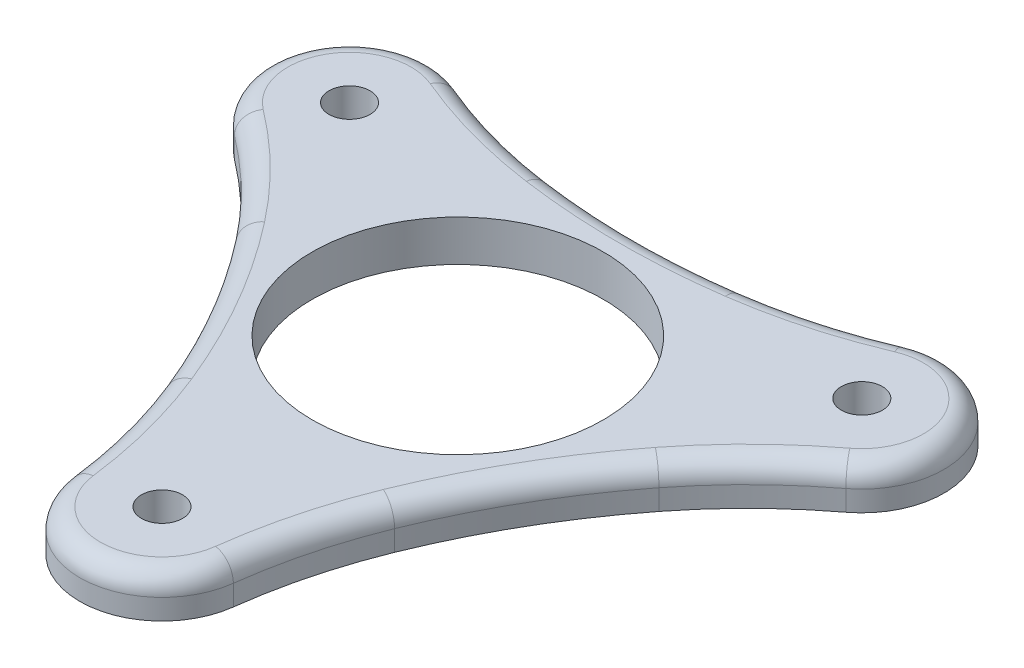
ISO-10303-21;
HEADER;
FILE_DESCRIPTION(('STEP AP214'),'2;1');
FILE_NAME('part.step','',(''),(''),'','','');
FILE_SCHEMA(('AUTOMOTIVE_DESIGN { 1 0 10303 214 1 1 1 1 }'));
ENDSEC;
DATA;
#1=APPLICATION_CONTEXT('core data for automotive mechanical design processes');
#2=APPLICATION_PROTOCOL_DEFINITION('international standard','automotive_design',2000,#1);
#3=PRODUCT_CONTEXT('',#1,'mechanical');
#4=PRODUCT('Part','Part','',(#3));
#5=PRODUCT_RELATED_PRODUCT_CATEGORY('part','',(#4));
#6=PRODUCT_DEFINITION_FORMATION('','',#4);
#7=PRODUCT_DEFINITION_CONTEXT('part definition',#1,'design');
#8=PRODUCT_DEFINITION('design','',#6,#7);
#9=PRODUCT_DEFINITION_SHAPE('','',#8);
#10=(LENGTH_UNIT() NAMED_UNIT(*) SI_UNIT(.MILLI.,.METRE.));
#11=(NAMED_UNIT(*) PLANE_ANGLE_UNIT() SI_UNIT($,.RADIAN.));
#12=(NAMED_UNIT(*) SI_UNIT($,.STERADIAN.) SOLID_ANGLE_UNIT());
#13=UNCERTAINTY_MEASURE_WITH_UNIT(LENGTH_MEASURE(1.E-05),#10,'distance_accuracy_value','');
#14=(GEOMETRIC_REPRESENTATION_CONTEXT(3) GLOBAL_UNCERTAINTY_ASSIGNED_CONTEXT((#13)) GLOBAL_UNIT_ASSIGNED_CONTEXT((#10,
#11,#12)) REPRESENTATION_CONTEXT('',''));
#15=CARTESIAN_POINT('',(0.,0.,0.));
#16=DIRECTION('',(0.,0.,1.));
#17=DIRECTION('',(1.,0.,0.));
#18=AXIS2_PLACEMENT_3D('',#15,#16,#17);
#19=CARTESIAN_POINT('',(0.,6.35,45.72));
#20=DIRECTION('',(0.,-1.,0.));
#21=DIRECTION('',(0.,0.,-1.));
#22=AXIS2_PLACEMENT_3D('',#19,#20,#21);
#23=CYLINDRICAL_SURFACE('',#22,12.7000000000002);
#24=DIRECTION('',(0.,-1.,0.));
#25=VECTOR('',#24,1.);
#26=CARTESIAN_POINT('',(12.6021572831834,6.35,47.2934140618133));
#27=LINE('',#26,#25);
#28=CARTESIAN_POINT('',(12.6021572831834,0.,47.2934140618133));
#29=VERTEX_POINT('',#28);
#30=CARTESIAN_POINT('',(12.6021572831834,3.175,47.2934140618133));
#31=VERTEX_POINT('',#30);
#32=EDGE_CURVE('E216',#29,#31,#27,.F.);
#33=ORIENTED_EDGE('',*,*,#32,.T.);
#34=CARTESIAN_POINT('',(0.,3.175,45.72));
#35=DIRECTION('',(0.,1.,0.));
#36=DIRECTION('',(0.,0.,1.));
#37=AXIS2_PLACEMENT_3D('',#34,#35,#36);
#38=CIRCLE('',#37,12.7000000000002);
#39=CARTESIAN_POINT('',(-12.6021572831834,3.175,47.293414061813));
#40=VERTEX_POINT('',#39);
#41=EDGE_CURVE('E264',#31,#40,#38,.F.);
#42=ORIENTED_EDGE('',*,*,#41,.T.);
#43=DIRECTION('',(0.,-1.,0.));
#44=VECTOR('',#43,1.);
#45=CARTESIAN_POINT('',(-12.6021572831834,6.35,47.293414061813));
#46=LINE('',#45,#44);
#47=CARTESIAN_POINT('',(-12.6021572831834,0.,47.293414061813));
#48=VERTEX_POINT('',#47);
#49=EDGE_CURVE('E219',#40,#48,#46,.T.);
#50=ORIENTED_EDGE('',*,*,#49,.T.);
#51=CARTESIAN_POINT('',(0.,0.,45.72));
#52=DIRECTION('',(0.,1.,0.));
#53=DIRECTION('',(0.,0.,1.));
#54=AXIS2_PLACEMENT_3D('',#51,#52,#53);
#55=CIRCLE('',#54,12.7000000000002);
#56=EDGE_CURVE('E334',#48,#29,#55,.T.);
#57=ORIENTED_EDGE('',*,*,#56,.T.);
#58=EDGE_LOOP('',(#33,#42,#50,#57));
#59=FACE_BOUND('',#58,.T.);
#60=ADVANCED_FACE('F37',(#59),#23,.T.);
#61=CARTESIAN_POINT('',(117.729531836529,6.35,67.9711768973876));
#62=DIRECTION('',(0.,-1.,0.));
#63=DIRECTION('',(0.,0.,-1.));
#64=AXIS2_PLACEMENT_3D('',#61,#62,#63);
#65=CYLINDRICAL_SURFACE('',#64,107.860080687774);
#66=DIRECTION('',(0.,-1.,0.));
#67=VECTOR('',#66,1.);
#68=CARTESIAN_POINT('',(32.7001507195463,6.35,1.61003350130014));
#69=LINE('',#68,#67);
#70=CARTESIAN_POINT('',(32.7001507195463,0.,1.61003350130014));
#71=VERTEX_POINT('',#70);
#72=CARTESIAN_POINT('',(32.7001507195463,3.175,1.61003350130014));
#73=VERTEX_POINT('',#72);
#74=EDGE_CURVE('E221',#71,#73,#69,.F.);
#75=ORIENTED_EDGE('',*,*,#74,.T.);
#76=CARTESIAN_POINT('',(117.729531836529,3.175,67.9711768973876));
#77=DIRECTION('',(0.,1.,0.));
#78=DIRECTION('',(0.,0.,1.));
#79=AXIS2_PLACEMENT_3D('',#76,#77,#78);
#80=CIRCLE('',#79,107.860080687774);
#81=CARTESIAN_POINT('',(17.7444052728414,3.175,27.5141444800616));
#82=VERTEX_POINT('',#81);
#83=EDGE_CURVE('E259',#73,#82,#80,.T.);
#84=ORIENTED_EDGE('',*,*,#83,.T.);
#85=DIRECTION('',(0.,-1.,0.));
#86=VECTOR('',#85,1.);
#87=CARTESIAN_POINT('',(17.7444052728414,6.35,27.5141444800616));
#88=LINE('',#87,#86);
#89=CARTESIAN_POINT('',(17.7444052728415,0.,27.5141444800617));
#90=VERTEX_POINT('',#89);
#91=EDGE_CURVE('E183',#82,#90,#88,.T.);
#92=ORIENTED_EDGE('',*,*,#91,.T.);
#93=CARTESIAN_POINT('',(117.729531836529,0.,67.9711768973876));
#94=DIRECTION('',(0.,1.,0.));
#95=DIRECTION('',(0.,0.,1.));
#96=AXIS2_PLACEMENT_3D('',#93,#94,#95);
#97=CIRCLE('',#96,107.860080687774);
#98=EDGE_CURVE('E195',#90,#71,#97,.F.);
#99=ORIENTED_EDGE('',*,*,#98,.T.);
#100=EDGE_LOOP('',(#75,#84,#92,#99));
#101=FACE_BOUND('',#100,.T.);
#102=ADVANCED_FACE('F340',(#101),#65,.F.);
#103=CARTESIAN_POINT('',(39.5946814610279,6.35,-22.8600000000044));
#104=DIRECTION('',(0.,-1.,0.));
#105=DIRECTION('',(0.,0.,-1.));
#106=AXIS2_PLACEMENT_3D('',#103,#104,#105);
#107=CYLINDRICAL_SURFACE('',#106,12.7000000000013);
#108=DIRECTION('',(0.,-1.,0.));
#109=VECTOR('',#108,1.);
#110=CARTESIAN_POINT('',(34.656219367638,6.35,-34.560495380636));
#111=LINE('',#110,#109);
#112=CARTESIAN_POINT('',(34.656219367638,0.,-34.560495380636));
#113=VERTEX_POINT('',#112);
#114=CARTESIAN_POINT('',(34.656219367638,3.175,-34.560495380636));
#115=VERTEX_POINT('',#114);
#116=EDGE_CURVE('E178',#113,#115,#111,.F.);
#117=ORIENTED_EDGE('',*,*,#116,.T.);
#118=CARTESIAN_POINT('',(39.5946814610279,3.175,-22.8600000000044));
#119=DIRECTION('',(0.,1.,0.));
#120=DIRECTION('',(0.,0.,1.));
#121=AXIS2_PLACEMENT_3D('',#118,#119,#120);
#122=CIRCLE('',#121,12.7000000000013);
#123=CARTESIAN_POINT('',(47.2583766508217,3.175,-12.7329186811858));
#124=VERTEX_POINT('',#123);
#125=EDGE_CURVE('E46',#115,#124,#122,.F.);
#126=ORIENTED_EDGE('',*,*,#125,.T.);
#127=DIRECTION('',(0.,-1.,0.));
#128=VECTOR('',#127,1.);
#129=CARTESIAN_POINT('',(47.2583766508217,6.35,-12.7329186811858));
#130=LINE('',#129,#128);
#131=CARTESIAN_POINT('',(47.2583766508217,0.,-12.7329186811858));
#132=VERTEX_POINT('',#131);
#133=EDGE_CURVE('E173',#124,#132,#130,.T.);
#134=ORIENTED_EDGE('',*,*,#133,.T.);
#135=CARTESIAN_POINT('',(39.5946814610279,0.,-22.8600000000044));
#136=DIRECTION('',(0.,1.,0.));
#137=DIRECTION('',(0.,0.,1.));
#138=AXIS2_PLACEMENT_3D('',#135,#136,#137);
#139=CIRCLE('',#138,12.7000000000013);
#140=EDGE_CURVE('E190',#132,#113,#139,.T.);
#141=ORIENTED_EDGE('',*,*,#140,.T.);
#142=EDGE_LOOP('',(#117,#126,#134,#141));
#143=FACE_BOUND('',#142,.T.);
#144=ADVANCED_FACE('F429',(#143),#107,.T.);
#145=CARTESIAN_POINT('',(7.22127890383623E-12,6.35,-135.942353794782));
#146=DIRECTION('',(0.,-1.,0.));
#147=DIRECTION('',(0.,0.,-1.));
#148=AXIS2_PLACEMENT_3D('',#145,#146,#147);
#149=CYLINDRICAL_SURFACE('',#148,107.860080687773);
#150=DIRECTION('',(0.,-1.,0.));
#151=VECTOR('',#150,1.);
#152=CARTESIAN_POINT('',(-14.9557454467395,6.35,-29.1241779813698));
#153=LINE('',#152,#151);
#154=CARTESIAN_POINT('',(-14.9557454467395,0.,-29.1241779813698));
#155=VERTEX_POINT('',#154);
#156=CARTESIAN_POINT('',(-14.9557454467395,3.175,-29.1241779813698));
#157=VERTEX_POINT('',#156);
#158=EDGE_CURVE('E174',#155,#157,#153,.F.);
#159=ORIENTED_EDGE('',*,*,#158,.T.);
#160=CARTESIAN_POINT('',(7.22127890383623E-12,3.175,-135.942353794782));
#161=DIRECTION('',(0.,1.,0.));
#162=DIRECTION('',(0.,0.,1.));
#163=AXIS2_PLACEMENT_3D('',#160,#161,#162);
#164=CIRCLE('',#163,107.860080687773);
#165=CARTESIAN_POINT('',(14.9557454467007,3.175,-29.1241779813624));
#166=VERTEX_POINT('',#165);
#167=EDGE_CURVE('E171',#157,#166,#164,.T.);
#168=ORIENTED_EDGE('',*,*,#167,.T.);
#169=DIRECTION('',(0.,-1.,0.));
#170=VECTOR('',#169,1.);
#171=CARTESIAN_POINT('',(14.9557454467007,6.35,-29.1241779813624));
#172=LINE('',#171,#170);
#173=CARTESIAN_POINT('',(14.9557454467008,0.,-29.1241779813623));
#174=VERTEX_POINT('',#173);
#175=EDGE_CURVE('E163',#166,#174,#172,.T.);
#176=ORIENTED_EDGE('',*,*,#175,.T.);
#177=CARTESIAN_POINT('',(7.22127890383623E-12,0.,-135.942353794782));
#178=DIRECTION('',(0.,1.,0.));
#179=DIRECTION('',(0.,0.,1.));
#180=AXIS2_PLACEMENT_3D('',#177,#178,#179);
#181=CIRCLE('',#180,107.860080687773);
#182=EDGE_CURVE('E168',#174,#155,#181,.F.);
#183=ORIENTED_EDGE('',*,*,#182,.T.);
#184=EDGE_LOOP('',(#159,#168,#176,#183));
#185=FACE_BOUND('',#184,.T.);
#186=ADVANCED_FACE('F166',(#185),#149,.F.);
#187=CARTESIAN_POINT('',(-39.5946814610245,6.35,-22.8600000000064));
#188=DIRECTION('',(0.,-1.,0.));
#189=DIRECTION('',(0.,0.,-1.));
#190=AXIS2_PLACEMENT_3D('',#187,#188,#189);
#191=CYLINDRICAL_SURFACE('',#190,12.7);
#192=DIRECTION('',(0.,-1.,0.));
#193=VECTOR('',#192,1.);
#194=CARTESIAN_POINT('',(-47.2583766508186,6.35,-12.7329186811896));
#195=LINE('',#194,#193);
#196=CARTESIAN_POINT('',(-47.2583766508186,0.,-12.7329186811896));
#197=VERTEX_POINT('',#196);
#198=CARTESIAN_POINT('',(-47.2583766508186,3.175,-12.7329186811896));
#199=VERTEX_POINT('',#198);
#200=EDGE_CURVE('E206',#197,#199,#195,.F.);
#201=ORIENTED_EDGE('',*,*,#200,.T.);
#202=CARTESIAN_POINT('',(-39.5946814610245,3.175,-22.8600000000064));
#203=DIRECTION('',(0.,1.,0.));
#204=DIRECTION('',(0.,0.,1.));
#205=AXIS2_PLACEMENT_3D('',#202,#203,#204);
#206=CIRCLE('',#205,12.7);
#207=CARTESIAN_POINT('',(-34.6562193676354,3.175,-34.560495380637));
#208=VERTEX_POINT('',#207);
#209=EDGE_CURVE('E272',#199,#208,#206,.F.);
#210=ORIENTED_EDGE('',*,*,#209,.T.);
#211=DIRECTION('',(0.,-1.,0.));
#212=VECTOR('',#211,1.);
#213=CARTESIAN_POINT('',(-34.6562193676354,6.35,-34.560495380637));
#214=LINE('',#213,#212);
#215=CARTESIAN_POINT('',(-34.6562193676354,0.,-34.560495380637));
#216=VERTEX_POINT('',#215);
#217=EDGE_CURVE('E209',#208,#216,#214,.T.);
#218=ORIENTED_EDGE('',*,*,#217,.T.);
#219=CARTESIAN_POINT('',(-39.5946814610245,0.,-22.8600000000064));
#220=DIRECTION('',(0.,1.,0.));
#221=DIRECTION('',(0.,0.,1.));
#222=AXIS2_PLACEMENT_3D('',#219,#220,#221);
#223=CIRCLE('',#222,12.7);
#224=EDGE_CURVE('E189',#216,#197,#223,.T.);
#225=ORIENTED_EDGE('',*,*,#224,.T.);
#226=EDGE_LOOP('',(#201,#210,#218,#225));
#227=FACE_BOUND('',#226,.T.);
#228=ADVANCED_FACE('F379',(#227),#191,.T.);
#229=CARTESIAN_POINT('',(39.5946814610245,6.35,-22.86));
#230=DIRECTION('',(0.,-1.,0.));
#231=DIRECTION('',(0.,0.,-1.));
#232=AXIS2_PLACEMENT_3D('',#229,#230,#231);
#233=CYLINDRICAL_SURFACE('',#232,3.175);
#234=CARTESIAN_POINT('',(39.5946814610245,6.35,-22.86));
#235=DIRECTION('',(0.,1.,0.));
#236=DIRECTION('',(0.,0.,1.));
#237=AXIS2_PLACEMENT_3D('',#234,#235,#236);
#238=CIRCLE('',#237,3.175);
#239=CARTESIAN_POINT('',(39.5946814610245,6.35,-19.685));
#240=VERTEX_POINT('',#239);
#241=EDGE_CURVE('E202',#240,#240,#238,.T.);
#242=ORIENTED_EDGE('',*,*,#241,.T.);
#243=EDGE_LOOP('',(#242));
#244=FACE_BOUND('',#243,.T.);
#245=CARTESIAN_POINT('',(39.5946814610245,0.,-22.86));
#246=DIRECTION('',(0.,1.,0.));
#247=DIRECTION('',(0.,0.,1.));
#248=AXIS2_PLACEMENT_3D('',#245,#246,#247);
#249=CIRCLE('',#248,3.175);
#250=CARTESIAN_POINT('',(39.5946814610245,0.,-19.685));
#251=VERTEX_POINT('',#250);
#252=EDGE_CURVE('E331',#251,#251,#249,.T.);
#253=ORIENTED_EDGE('',*,*,#252,.F.);
#254=EDGE_LOOP('',(#253));
#255=FACE_BOUND('',#254,.T.);
#256=ADVANCED_FACE('F433',(#244,#255),#233,.F.);
#257=CARTESIAN_POINT('',(-39.5946814610245,6.35,-22.86));
#258=DIRECTION('',(0.,-1.,0.));
#259=DIRECTION('',(0.,0.,-1.));
#260=AXIS2_PLACEMENT_3D('',#257,#258,#259);
#261=CYLINDRICAL_SURFACE('',#260,3.175);
#262=CARTESIAN_POINT('',(-39.5946814610245,6.35,-22.86));
#263=DIRECTION('',(0.,1.,0.));
#264=DIRECTION('',(0.,0.,1.));
#265=AXIS2_PLACEMENT_3D('',#262,#263,#264);
#266=CIRCLE('',#265,3.175);
#267=CARTESIAN_POINT('',(-39.5946814610245,6.35,-19.685));
#268=VERTEX_POINT('',#267);
#269=EDGE_CURVE('E734',#268,#268,#266,.T.);
#270=ORIENTED_EDGE('',*,*,#269,.T.);
#271=EDGE_LOOP('',(#270));
#272=FACE_BOUND('',#271,.T.);
#273=CARTESIAN_POINT('',(-39.5946814610245,0.,-22.86));
#274=DIRECTION('',(0.,1.,0.));
#275=DIRECTION('',(0.,0.,1.));
#276=AXIS2_PLACEMENT_3D('',#273,#274,#275);
#277=CIRCLE('',#276,3.175);
#278=CARTESIAN_POINT('',(-39.5946814610245,0.,-19.685));
#279=VERTEX_POINT('',#278);
#280=EDGE_CURVE('E324',#279,#279,#277,.T.);
#281=ORIENTED_EDGE('',*,*,#280,.F.);
#282=EDGE_LOOP('',(#281));
#283=FACE_BOUND('',#282,.T.);
#284=ADVANCED_FACE('F436',(#272,#283),#261,.F.);
#285=CARTESIAN_POINT('',(0.,6.35,45.72));
#286=DIRECTION('',(0.,-1.,0.));
#287=DIRECTION('',(0.,0.,-1.));
#288=AXIS2_PLACEMENT_3D('',#285,#286,#287);
#289=CYLINDRICAL_SURFACE('',#288,3.175);
#290=CARTESIAN_POINT('',(0.,6.35,45.72));
#291=DIRECTION('',(0.,1.,0.));
#292=DIRECTION('',(0.,0.,1.));
#293=AXIS2_PLACEMENT_3D('',#290,#291,#292);
#294=CIRCLE('',#293,3.175);
#295=CARTESIAN_POINT('',(0.,6.35,48.895));
#296=VERTEX_POINT('',#295);
#297=EDGE_CURVE('E731',#296,#296,#294,.T.);
#298=ORIENTED_EDGE('',*,*,#297,.T.);
#299=EDGE_LOOP('',(#298));
#300=FACE_BOUND('',#299,.T.);
#301=CARTESIAN_POINT('',(0.,0.,45.72));
#302=DIRECTION('',(0.,1.,0.));
#303=DIRECTION('',(0.,0.,1.));
#304=AXIS2_PLACEMENT_3D('',#301,#302,#303);
#305=CIRCLE('',#304,3.175);
#306=CARTESIAN_POINT('',(0.,0.,48.895));
#307=VERTEX_POINT('',#306);
#308=EDGE_CURVE('E319',#307,#307,#305,.T.);
#309=ORIENTED_EDGE('',*,*,#308,.F.);
#310=EDGE_LOOP('',(#309));
#311=FACE_BOUND('',#310,.T.);
#312=ADVANCED_FACE('F440',(#300,#311),#289,.F.);
#313=CARTESIAN_POINT('',(0.,6.35,0.));
#314=DIRECTION('',(0.,-1.,0.));
#315=DIRECTION('',(0.,0.,-1.));
#316=AXIS2_PLACEMENT_3D('',#313,#314,#315);
#317=CYLINDRICAL_SURFACE('',#316,22.5);
#318=CARTESIAN_POINT('',(0.,6.35,0.));
#319=DIRECTION('',(0.,1.,0.));
#320=DIRECTION('',(0.,0.,1.));
#321=AXIS2_PLACEMENT_3D('',#318,#319,#320);
#322=CIRCLE('',#321,22.5);
#323=CARTESIAN_POINT('',(0.,6.35,22.5));
#324=VERTEX_POINT('',#323);
#325=EDGE_CURVE('E201',#324,#324,#322,.T.);
#326=ORIENTED_EDGE('',*,*,#325,.T.);
#327=EDGE_LOOP('',(#326));
#328=FACE_BOUND('',#327,.T.);
#329=CARTESIAN_POINT('',(0.,0.,0.));
#330=DIRECTION('',(0.,1.,0.));
#331=DIRECTION('',(0.,0.,1.));
#332=AXIS2_PLACEMENT_3D('',#329,#330,#331);
#333=CIRCLE('',#332,22.5);
#334=CARTESIAN_POINT('',(0.,0.,22.5));
#335=VERTEX_POINT('',#334);
#336=EDGE_CURVE('E313',#335,#335,#333,.T.);
#337=ORIENTED_EDGE('',*,*,#336,.F.);
#338=EDGE_LOOP('',(#337));
#339=FACE_BOUND('',#338,.T.);
#340=ADVANCED_FACE('F444',(#328,#339),#317,.F.);
#341=CARTESIAN_POINT('',(-117.729531836531,6.35,67.9711768973792));
#342=DIRECTION('',(0.,-1.,0.));
#343=DIRECTION('',(0.,0.,-1.));
#344=AXIS2_PLACEMENT_3D('',#341,#342,#343);
#345=CYLINDRICAL_SURFACE('',#344,107.860080687774);
#346=DIRECTION('',(0.,-1.,0.));
#347=VECTOR('',#346,1.);
#348=CARTESIAN_POINT('',(-17.7444052728351,6.35,27.5141444800759));
#349=LINE('',#348,#347);
#350=CARTESIAN_POINT('',(-17.7444052728351,0.,27.5141444800759));
#351=VERTEX_POINT('',#350);
#352=CARTESIAN_POINT('',(-17.7444052728351,3.175,27.5141444800759));
#353=VERTEX_POINT('',#352);
#354=EDGE_CURVE('E211',#351,#353,#349,.F.);
#355=ORIENTED_EDGE('',*,*,#354,.T.);
#356=CARTESIAN_POINT('',(-117.729531836531,3.175,67.9711768973792));
#357=DIRECTION('',(0.,1.,0.));
#358=DIRECTION('',(0.,0.,1.));
#359=AXIS2_PLACEMENT_3D('',#356,#357,#358);
#360=CIRCLE('',#359,107.860080687774);
#361=CARTESIAN_POINT('',(-32.7001507195501,3.175,1.6100335012906));
#362=VERTEX_POINT('',#361);
#363=EDGE_CURVE('E268',#353,#362,#360,.T.);
#364=ORIENTED_EDGE('',*,*,#363,.T.);
#365=DIRECTION('',(0.,-1.,0.));
#366=VECTOR('',#365,1.);
#367=CARTESIAN_POINT('',(-32.7001507195501,6.35,1.6100335012906));
#368=LINE('',#367,#366);
#369=CARTESIAN_POINT('',(-32.7001507195501,0.,1.6100335012906));
#370=VERTEX_POINT('',#369);
#371=EDGE_CURVE('E214',#362,#370,#368,.T.);
#372=ORIENTED_EDGE('',*,*,#371,.T.);
#373=CARTESIAN_POINT('',(-117.729531836531,0.,67.9711768973792));
#374=DIRECTION('',(0.,1.,0.));
#375=DIRECTION('',(0.,0.,1.));
#376=AXIS2_PLACEMENT_3D('',#373,#374,#375);
#377=CIRCLE('',#376,107.860080687774);
#378=EDGE_CURVE('E193',#370,#351,#377,.F.);
#379=ORIENTED_EDGE('',*,*,#378,.T.);
#380=EDGE_LOOP('',(#355,#364,#372,#379));
#381=FACE_BOUND('',#380,.T.);
#382=ADVANCED_FACE('F371',(#381),#345,.F.);
#383=CARTESIAN_POINT('',(0.,6.35,0.));
#384=DIRECTION('',(0.,1.,0.));
#385=DIRECTION('',(0.,0.,1.));
#386=AXIS2_PLACEMENT_3D('',#383,#384,#385);
#387=PLANE('',#386);
#388=CARTESIAN_POINT('',(90.7355324389194,6.35,57.0485812450558));
#389=DIRECTION('',(0.,1.,0.));
#390=DIRECTION('',(0.,0.,1.));
#391=AXIS2_PLACEMENT_3D('',#388,#389,#390);
#392=CIRCLE('',#391,81.915);
#393=CARTESIAN_POINT('',(9.45161796238758,6.35,46.90006054636));
#394=VERTEX_POINT('',#393);
#395=CARTESIAN_POINT('',(14.8012146613061,6.35,26.3232397717958));
#396=VERTEX_POINT('',#395);
#397=EDGE_CURVE('E254',#394,#396,#392,.F.);
#398=ORIENTED_EDGE('',*,*,#397,.T.);
#399=CARTESIAN_POINT('',(117.729531836529,6.35,67.9711768973876));
#400=DIRECTION('',(0.,1.,0.));
#401=DIRECTION('',(0.,0.,1.));
#402=AXIS2_PLACEMENT_3D('',#399,#400,#401);
#403=CIRCLE('',#402,111.035080687774);
#404=CARTESIAN_POINT('',(30.1972016829337,6.35,-0.343391982336278));
#405=VERTEX_POINT('',#404);
#406=EDGE_CURVE('E256',#396,#405,#403,.F.);
#407=ORIENTED_EDGE('',*,*,#406,.T.);
#408=CARTESIAN_POINT('',(94.7732868275384,6.35,50.054985495483));
#409=DIRECTION('',(0.,1.,0.));
#410=DIRECTION('',(0.,0.,1.));
#411=AXIS2_PLACEMENT_3D('',#408,#409,#410);
#412=CIRCLE('',#411,81.915);
#413=CARTESIAN_POINT('',(45.3424528533735,6.35,-15.2646890108902));
#414=VERTEX_POINT('',#413);
#415=EDGE_CURVE('E234',#405,#414,#412,.F.);
#416=ORIENTED_EDGE('',*,*,#415,.T.);
#417=CARTESIAN_POINT('',(39.5946814610279,6.35,-22.8600000000044));
#418=DIRECTION('',(0.,1.,0.));
#419=DIRECTION('',(0.,0.,1.));
#420=AXIS2_PLACEMENT_3D('',#417,#418,#419);
#421=CIRCLE('',#420,9.52500000000126);
#422=CARTESIAN_POINT('',(35.8908348909853,6.35,-31.6353715354784));
#423=VERTEX_POINT('',#422);
#424=EDGE_CURVE('E236',#414,#423,#421,.T.);
#425=ORIENTED_EDGE('',*,*,#424,.T.);
#426=CARTESIAN_POINT('',(4.03775438862305,6.35,-107.103566740545));
#427=DIRECTION('',(0.,1.,0.));
#428=DIRECTION('',(0.,0.,1.));
#429=AXIS2_PLACEMENT_3D('',#426,#427,#428);
#430=CIRCLE('',#429,81.915);
#431=CARTESIAN_POINT('',(15.3959870216232,6.35,-25.9798477894598));
#432=VERTEX_POINT('',#431);
#433=EDGE_CURVE('E238',#423,#432,#430,.F.);
#434=ORIENTED_EDGE('',*,*,#433,.T.);
#435=CARTESIAN_POINT('',(7.22127890383623E-12,6.35,-135.942353794782));
#436=DIRECTION('',(0.,1.,0.));
#437=DIRECTION('',(0.,0.,1.));
#438=AXIS2_PLACEMENT_3D('',#435,#436,#437);
#439=CIRCLE('',#438,111.035080687773);
#440=CARTESIAN_POINT('',(-15.3959870216636,6.35,-25.9798477894675));
#441=VERTEX_POINT('',#440);
#442=EDGE_CURVE('E240',#432,#441,#439,.F.);
#443=ORIENTED_EDGE('',*,*,#442,.T.);
#444=CARTESIAN_POINT('',(-4.03775438862298,6.35,-107.103566740547));
#445=DIRECTION('',(0.,1.,0.));
#446=DIRECTION('',(0.,0.,1.));
#447=AXIS2_PLACEMENT_3D('',#444,#445,#446);
#448=CIRCLE('',#447,81.915);
#449=CARTESIAN_POINT('',(-35.8908348909827,6.35,-31.6353715354793));
#450=VERTEX_POINT('',#449);
#451=EDGE_CURVE('E242',#441,#450,#448,.F.);
#452=ORIENTED_EDGE('',*,*,#451,.T.);
#453=CARTESIAN_POINT('',(-39.5946814610245,6.35,-22.8600000000064));
#454=DIRECTION('',(0.,1.,0.));
#455=DIRECTION('',(0.,0.,1.));
#456=AXIS2_PLACEMENT_3D('',#453,#454,#455);
#457=CIRCLE('',#456,9.525);
#458=CARTESIAN_POINT('',(-45.3424528533701,6.35,-15.2646890108938));
#459=VERTEX_POINT('',#458);
#460=EDGE_CURVE('E244',#450,#459,#457,.T.);
#461=ORIENTED_EDGE('',*,*,#460,.T.);
#462=CARTESIAN_POINT('',(-94.7732868275414,6.35,50.0549854954746));
#463=DIRECTION('',(0.,1.,0.));
#464=DIRECTION('',(0.,0.,1.));
#465=AXIS2_PLACEMENT_3D('',#462,#463,#464);
#466=CIRCLE('',#465,81.915);
#467=CARTESIAN_POINT('',(-30.1972016829376,6.35,-0.343391982345848));
#468=VERTEX_POINT('',#467);
#469=EDGE_CURVE('E246',#459,#468,#466,.F.);
#470=ORIENTED_EDGE('',*,*,#469,.T.);
#471=CARTESIAN_POINT('',(-117.729531836531,6.35,67.9711768973792));
#472=DIRECTION('',(0.,1.,0.));
#473=DIRECTION('',(0.,0.,1.));
#474=AXIS2_PLACEMENT_3D('',#471,#472,#473);
#475=CIRCLE('',#474,111.035080687774);
#476=CARTESIAN_POINT('',(-14.8012146612995,6.35,26.3232397718107));
#477=VERTEX_POINT('',#476);
#478=EDGE_CURVE('E248',#468,#477,#475,.F.);
#479=ORIENTED_EDGE('',*,*,#478,.T.);
#480=CARTESIAN_POINT('',(-90.7355324389197,6.35,57.0485812450537));
#481=DIRECTION('',(0.,1.,0.));
#482=DIRECTION('',(0.,0.,1.));
#483=AXIS2_PLACEMENT_3D('',#480,#481,#482);
#484=CIRCLE('',#483,81.915);
#485=CARTESIAN_POINT('',(-9.45161796238762,6.35,46.9000605463598));
#486=VERTEX_POINT('',#485);
#487=EDGE_CURVE('E250',#477,#486,#484,.F.);
#488=ORIENTED_EDGE('',*,*,#487,.T.);
#489=CARTESIAN_POINT('',(0.,6.35,45.72));
#490=DIRECTION('',(0.,1.,0.));
#491=DIRECTION('',(0.,0.,1.));
#492=AXIS2_PLACEMENT_3D('',#489,#490,#491);
#493=CIRCLE('',#492,9.52500000000016);
#494=EDGE_CURVE('E252',#486,#394,#493,.T.);
#495=ORIENTED_EDGE('',*,*,#494,.T.);
#496=EDGE_LOOP('',(#398,#407,#416,#425,#434,#443,#452,#461,#470,#479,#488,#495));
#497=FACE_BOUND('',#496,.T.);
#498=ORIENTED_EDGE('',*,*,#325,.F.);
#499=EDGE_LOOP('',(#498));
#500=FACE_BOUND('',#499,.T.);
#501=ORIENTED_EDGE('',*,*,#297,.F.);
#502=EDGE_LOOP('',(#501));
#503=FACE_BOUND('',#502,.T.);
#504=ORIENTED_EDGE('',*,*,#269,.F.);
#505=EDGE_LOOP('',(#504));
#506=FACE_BOUND('',#505,.T.);
#507=ORIENTED_EDGE('',*,*,#241,.F.);
#508=EDGE_LOOP('',(#507));
#509=FACE_BOUND('',#508,.T.);
#510=ADVANCED_FACE('F397',(#497,#500,#503,#506,#509),#387,.T.);
#511=CARTESIAN_POINT('',(0.,0.,0.));
#512=DIRECTION('',(0.,1.,0.));
#513=DIRECTION('',(0.,0.,1.));
#514=AXIS2_PLACEMENT_3D('',#511,#512,#513);
#515=PLANE('',#514);
#516=ORIENTED_EDGE('',*,*,#336,.T.);
#517=EDGE_LOOP('',(#516));
#518=FACE_BOUND('',#517,.T.);
#519=ORIENTED_EDGE('',*,*,#308,.T.);
#520=EDGE_LOOP('',(#519));
#521=FACE_BOUND('',#520,.T.);
#522=ORIENTED_EDGE('',*,*,#280,.T.);
#523=EDGE_LOOP('',(#522));
#524=FACE_BOUND('',#523,.T.);
#525=ORIENTED_EDGE('',*,*,#252,.T.);
#526=EDGE_LOOP('',(#525));
#527=FACE_BOUND('',#526,.T.);
#528=ORIENTED_EDGE('',*,*,#56,.F.);
#529=CARTESIAN_POINT('',(-90.7355324389197,0.,57.0485812450537));
#530=DIRECTION('',(0.,1.,0.));
#531=DIRECTION('',(0.,0.,1.));
#532=AXIS2_PLACEMENT_3D('',#529,#530,#531);
#533=CIRCLE('',#532,78.74);
#534=EDGE_CURVE('E228',#48,#351,#533,.T.);
#535=ORIENTED_EDGE('',*,*,#534,.T.);
#536=ORIENTED_EDGE('',*,*,#378,.F.);
#537=CARTESIAN_POINT('',(-94.7732868275414,0.,50.0549854954746));
#538=DIRECTION('',(0.,1.,0.));
#539=DIRECTION('',(0.,0.,1.));
#540=AXIS2_PLACEMENT_3D('',#537,#538,#539);
#541=CIRCLE('',#540,78.74);
#542=EDGE_CURVE('E226',#370,#197,#541,.T.);
#543=ORIENTED_EDGE('',*,*,#542,.T.);
#544=ORIENTED_EDGE('',*,*,#224,.F.);
#545=CARTESIAN_POINT('',(-4.03775438862298,0.,-107.103566740547));
#546=DIRECTION('',(0.,1.,0.));
#547=DIRECTION('',(0.,0.,1.));
#548=AXIS2_PLACEMENT_3D('',#545,#546,#547);
#549=CIRCLE('',#548,78.74);
#550=EDGE_CURVE('E182',#216,#155,#549,.T.);
#551=ORIENTED_EDGE('',*,*,#550,.T.);
#552=ORIENTED_EDGE('',*,*,#182,.F.);
#553=CARTESIAN_POINT('',(4.03775438862305,0.,-107.103566740545));
#554=DIRECTION('',(0.,1.,0.));
#555=DIRECTION('',(0.,0.,1.));
#556=AXIS2_PLACEMENT_3D('',#553,#554,#555);
#557=CIRCLE('',#556,78.74);
#558=EDGE_CURVE('E176',#174,#113,#557,.T.);
#559=ORIENTED_EDGE('',*,*,#558,.T.);
#560=ORIENTED_EDGE('',*,*,#140,.F.);
#561=CARTESIAN_POINT('',(94.7732868275384,0.,50.054985495483));
#562=DIRECTION('',(0.,1.,0.));
#563=DIRECTION('',(0.,0.,1.));
#564=AXIS2_PLACEMENT_3D('',#561,#562,#563);
#565=CIRCLE('',#564,78.74);
#566=EDGE_CURVE('E232',#132,#71,#565,.T.);
#567=ORIENTED_EDGE('',*,*,#566,.T.);
#568=ORIENTED_EDGE('',*,*,#98,.F.);
#569=CARTESIAN_POINT('',(90.7355324389194,0.,57.0485812450558));
#570=DIRECTION('',(0.,1.,0.));
#571=DIRECTION('',(0.,0.,1.));
#572=AXIS2_PLACEMENT_3D('',#569,#570,#571);
#573=CIRCLE('',#572,78.74);
#574=EDGE_CURVE('E230',#90,#29,#573,.T.);
#575=ORIENTED_EDGE('',*,*,#574,.T.);
#576=EDGE_LOOP('',(#528,#535,#536,#543,#544,#551,#552,#559,#560,#567,#568,#575));
#577=FACE_BOUND('',#576,.T.);
#578=ADVANCED_FACE('F186',(#518,#521,#524,#527,#577),#515,.F.);
#579=CARTESIAN_POINT('',(4.03775438862305,6.35,-107.103566740545));
#580=DIRECTION('',(0.,-1.,0.));
#581=DIRECTION('',(0.,0.,-1.));
#582=AXIS2_PLACEMENT_3D('',#579,#580,#581);
#583=CYLINDRICAL_SURFACE('',#582,78.74);
#584=ORIENTED_EDGE('',*,*,#175,.F.);
#585=CARTESIAN_POINT('',(4.03775438862305,3.175,-107.103566740545));
#586=DIRECTION('',(0.,1.,0.));
#587=DIRECTION('',(0.,0.,1.));
#588=AXIS2_PLACEMENT_3D('',#585,#586,#587);
#589=CIRCLE('',#588,78.74);
#590=EDGE_CURVE('E61',#166,#115,#589,.T.);
#591=ORIENTED_EDGE('',*,*,#590,.T.);
#592=ORIENTED_EDGE('',*,*,#116,.F.);
#593=ORIENTED_EDGE('',*,*,#558,.F.);
#594=EDGE_LOOP('',(#584,#591,#592,#593));
#595=FACE_BOUND('',#594,.T.);
#596=ADVANCED_FACE('F177',(#595),#583,.F.);
#597=CARTESIAN_POINT('',(-4.03775438862298,6.35,-107.103566740547));
#598=DIRECTION('',(0.,-1.,0.));
#599=DIRECTION('',(0.,0.,-1.));
#600=AXIS2_PLACEMENT_3D('',#597,#598,#599);
#601=CYLINDRICAL_SURFACE('',#600,78.74);
#602=ORIENTED_EDGE('',*,*,#217,.F.);
#603=CARTESIAN_POINT('',(-4.03775438862298,3.175,-107.103566740547));
#604=DIRECTION('',(0.,1.,0.));
#605=DIRECTION('',(0.,0.,1.));
#606=AXIS2_PLACEMENT_3D('',#603,#604,#605);
#607=CIRCLE('',#606,78.74);
#608=EDGE_CURVE('E274',#208,#157,#607,.T.);
#609=ORIENTED_EDGE('',*,*,#608,.T.);
#610=ORIENTED_EDGE('',*,*,#158,.F.);
#611=ORIENTED_EDGE('',*,*,#550,.F.);
#612=EDGE_LOOP('',(#602,#609,#610,#611));
#613=FACE_BOUND('',#612,.T.);
#614=ADVANCED_FACE('F383',(#613),#601,.F.);
#615=CARTESIAN_POINT('',(-94.7732868275414,6.35,50.0549854954746));
#616=DIRECTION('',(0.,-1.,0.));
#617=DIRECTION('',(0.,0.,-1.));
#618=AXIS2_PLACEMENT_3D('',#615,#616,#617);
#619=CYLINDRICAL_SURFACE('',#618,78.74);
#620=ORIENTED_EDGE('',*,*,#371,.F.);
#621=CARTESIAN_POINT('',(-94.7732868275414,3.175,50.0549854954746));
#622=DIRECTION('',(0.,1.,0.));
#623=DIRECTION('',(0.,0.,1.));
#624=AXIS2_PLACEMENT_3D('',#621,#622,#623);
#625=CIRCLE('',#624,78.74);
#626=EDGE_CURVE('E270',#362,#199,#625,.T.);
#627=ORIENTED_EDGE('',*,*,#626,.T.);
#628=ORIENTED_EDGE('',*,*,#200,.F.);
#629=ORIENTED_EDGE('',*,*,#542,.F.);
#630=EDGE_LOOP('',(#620,#627,#628,#629));
#631=FACE_BOUND('',#630,.T.);
#632=ADVANCED_FACE('F377',(#631),#619,.F.);
#633=CARTESIAN_POINT('',(-90.7355324389197,6.35,57.0485812450537));
#634=DIRECTION('',(0.,-1.,0.));
#635=DIRECTION('',(0.,0.,-1.));
#636=AXIS2_PLACEMENT_3D('',#633,#634,#635);
#637=CYLINDRICAL_SURFACE('',#636,78.74);
#638=ORIENTED_EDGE('',*,*,#49,.F.);
#639=CARTESIAN_POINT('',(-90.7355324389197,3.175,57.0485812450537));
#640=DIRECTION('',(0.,1.,0.));
#641=DIRECTION('',(0.,0.,1.));
#642=AXIS2_PLACEMENT_3D('',#639,#640,#641);
#643=CIRCLE('',#642,78.74);
#644=EDGE_CURVE('E266',#40,#353,#643,.T.);
#645=ORIENTED_EDGE('',*,*,#644,.T.);
#646=ORIENTED_EDGE('',*,*,#354,.F.);
#647=ORIENTED_EDGE('',*,*,#534,.F.);
#648=EDGE_LOOP('',(#638,#645,#646,#647));
#649=FACE_BOUND('',#648,.T.);
#650=ADVANCED_FACE('F368',(#649),#637,.F.);
#651=CARTESIAN_POINT('',(90.7355324389194,6.35,57.0485812450558));
#652=DIRECTION('',(0.,-1.,0.));
#653=DIRECTION('',(0.,0.,-1.));
#654=AXIS2_PLACEMENT_3D('',#651,#652,#653);
#655=CYLINDRICAL_SURFACE('',#654,78.74);
#656=ORIENTED_EDGE('',*,*,#91,.F.);
#657=CARTESIAN_POINT('',(90.7355324389194,3.175,57.0485812450558));
#658=DIRECTION('',(0.,1.,0.));
#659=DIRECTION('',(0.,0.,1.));
#660=AXIS2_PLACEMENT_3D('',#657,#658,#659);
#661=CIRCLE('',#660,78.74);
#662=EDGE_CURVE('E262',#82,#31,#661,.T.);
#663=ORIENTED_EDGE('',*,*,#662,.T.);
#664=ORIENTED_EDGE('',*,*,#32,.F.);
#665=ORIENTED_EDGE('',*,*,#574,.F.);
#666=EDGE_LOOP('',(#656,#663,#664,#665));
#667=FACE_BOUND('',#666,.T.);
#668=ADVANCED_FACE('F359',(#667),#655,.F.);
#669=CARTESIAN_POINT('',(94.7732868275384,6.35,50.054985495483));
#670=DIRECTION('',(0.,-1.,0.));
#671=DIRECTION('',(0.,0.,-1.));
#672=AXIS2_PLACEMENT_3D('',#669,#670,#671);
#673=CYLINDRICAL_SURFACE('',#672,78.74);
#674=ORIENTED_EDGE('',*,*,#133,.F.);
#675=CARTESIAN_POINT('',(94.7732868275384,3.175,50.054985495483));
#676=DIRECTION('',(0.,1.,0.));
#677=DIRECTION('',(0.,0.,1.));
#678=AXIS2_PLACEMENT_3D('',#675,#676,#677);
#679=CIRCLE('',#678,78.74);
#680=EDGE_CURVE('E11',#124,#73,#679,.T.);
#681=ORIENTED_EDGE('',*,*,#680,.T.);
#682=ORIENTED_EDGE('',*,*,#74,.F.);
#683=ORIENTED_EDGE('',*,*,#566,.F.);
#684=EDGE_LOOP('',(#674,#681,#682,#683));
#685=FACE_BOUND('',#684,.T.);
#686=ADVANCED_FACE('F346',(#685),#673,.F.);
#687=CARTESIAN_POINT('',(-39.5946814610245,3.175,-22.8600000000064));
#688=DIRECTION('',(0.,1.,0.));
#689=DIRECTION('',(0.,0.,1.));
#690=AXIS2_PLACEMENT_3D('',#687,#688,#689);
#691=TOROIDAL_SURFACE('',#690,9.525,3.175);
#692=CARTESIAN_POINT('',(-35.8908348909827,3.175,-31.6353715354793));
#693=DIRECTION('',(0.921298848868554,0.,0.388855282944024));
#694=DIRECTION('',(0.388855282944024,0.,-0.921298848868554));
#695=AXIS2_PLACEMENT_3D('',#692,#693,#694);
#696=CIRCLE('',#695,3.175);
#697=EDGE_CURVE('E306',#208,#450,#696,.T.);
#698=ORIENTED_EDGE('',*,*,#697,.F.);
#699=ORIENTED_EDGE('',*,*,#209,.F.);
#700=CARTESIAN_POINT('',(-45.3424528533701,3.175,-15.2646890108938));
#701=DIRECTION('',(0.79740797785959,0.,0.603440566125513));
#702=DIRECTION('',(0.603440566125513,0.,-0.79740797785959));
#703=AXIS2_PLACEMENT_3D('',#700,#701,#702);
#704=CIRCLE('',#703,3.175);
#705=EDGE_CURVE('E41',#459,#199,#704,.T.);
#706=ORIENTED_EDGE('',*,*,#705,.F.);
#707=ORIENTED_EDGE('',*,*,#460,.F.);
#708=EDGE_LOOP('',(#698,#699,#706,#707));
#709=FACE_BOUND('',#708,.T.);
#710=ADVANCED_FACE('F39',(#709),#691,.T.);
#711=CARTESIAN_POINT('',(-94.7732868275414,3.175,50.0549854954746));
#712=DIRECTION('',(0.,1.,0.));
#713=DIRECTION('',(0.,0.,1.));
#714=AXIS2_PLACEMENT_3D('',#711,#712,#713);
#715=TOROIDAL_SURFACE('',#714,81.915,3.175);
#716=ORIENTED_EDGE('',*,*,#705,.T.);
#717=ORIENTED_EDGE('',*,*,#626,.F.);
#718=CARTESIAN_POINT('',(-30.1972016829376,3.175,-0.343391982345848));
#719=DIRECTION('',(0.615252120830378,0.,0.7883304052323));
#720=DIRECTION('',(0.7883304052323,0.,-0.615252120830378));
#721=AXIS2_PLACEMENT_3D('',#718,#719,#720);
#722=CIRCLE('',#721,3.175);
#723=EDGE_CURVE('E304',#468,#362,#722,.T.);
#724=ORIENTED_EDGE('',*,*,#723,.F.);
#725=ORIENTED_EDGE('',*,*,#469,.F.);
#726=EDGE_LOOP('',(#716,#717,#724,#725));
#727=FACE_BOUND('',#726,.T.);
#728=ADVANCED_FACE('F415',(#727),#715,.T.);
#729=CARTESIAN_POINT('',(-4.03775438862298,3.175,-107.103566740547));
#730=DIRECTION('',(0.,1.,0.));
#731=DIRECTION('',(0.,0.,1.));
#732=AXIS2_PLACEMENT_3D('',#729,#730,#731);
#733=TOROIDAL_SURFACE('',#732,81.915,3.175);
#734=ORIENTED_EDGE('',*,*,#697,.T.);
#735=ORIENTED_EDGE('',*,*,#451,.F.);
#736=CARTESIAN_POINT('',(-15.3959870216636,3.175,-25.9798477894675));
#737=DIRECTION('',(0.990340217921986,0.,0.138658763755608));
#738=DIRECTION('',(0.138658763755608,0.,-0.990340217921986));
#739=AXIS2_PLACEMENT_3D('',#736,#737,#738);
#740=CIRCLE('',#739,3.175);
#741=EDGE_CURVE('E301',#157,#441,#740,.T.);
#742=ORIENTED_EDGE('',*,*,#741,.F.);
#743=ORIENTED_EDGE('',*,*,#608,.F.);
#744=EDGE_LOOP('',(#734,#735,#742,#743));
#745=FACE_BOUND('',#744,.T.);
#746=ADVANCED_FACE('F385',(#745),#733,.T.);
#747=CARTESIAN_POINT('',(-117.729531836531,3.175,67.9711768973792));
#748=DIRECTION('',(0.,1.,0.));
#749=DIRECTION('',(0.,0.,1.));
#750=AXIS2_PLACEMENT_3D('',#747,#748,#749);
#751=TOROIDAL_SURFACE('',#750,111.035080687774,3.175);
#752=ORIENTED_EDGE('',*,*,#723,.T.);
#753=ORIENTED_EDGE('',*,*,#363,.F.);
#754=CARTESIAN_POINT('',(-14.8012146612995,3.175,26.3232397718107));
#755=DIRECTION('',(0.375088097091412,0.,0.926989168987612));
#756=DIRECTION('',(0.926989168987612,0.,-0.375088097091412));
#757=AXIS2_PLACEMENT_3D('',#754,#755,#756);
#758=CIRCLE('',#757,3.175);
#759=EDGE_CURVE('E298',#477,#353,#758,.T.);
#760=ORIENTED_EDGE('',*,*,#759,.F.);
#761=ORIENTED_EDGE('',*,*,#478,.F.);
#762=EDGE_LOOP('',(#752,#753,#760,#761));
#763=FACE_BOUND('',#762,.T.);
#764=ADVANCED_FACE('F413',(#763),#751,.T.);
#765=CARTESIAN_POINT('',(7.22127890383623E-12,3.175,-135.942353794782));
#766=DIRECTION('',(0.,1.,0.));
#767=DIRECTION('',(0.,0.,1.));
#768=AXIS2_PLACEMENT_3D('',#765,#766,#767);
#769=TOROIDAL_SURFACE('',#768,111.035080687773,3.175);
#770=ORIENTED_EDGE('',*,*,#741,.T.);
#771=ORIENTED_EDGE('',*,*,#442,.F.);
#772=CARTESIAN_POINT('',(15.3959870216232,3.175,-25.9798477894598));
#773=DIRECTION('',(0.990340217922055,0.,-0.138658763755114));
#774=DIRECTION('',(-0.138658763755114,0.,-0.990340217922055));
#775=AXIS2_PLACEMENT_3D('',#772,#773,#774);
#776=CIRCLE('',#775,3.175);
#777=EDGE_CURVE('E295',#166,#432,#776,.T.);
#778=ORIENTED_EDGE('',*,*,#777,.F.);
#779=ORIENTED_EDGE('',*,*,#167,.F.);
#780=EDGE_LOOP('',(#770,#771,#778,#779));
#781=FACE_BOUND('',#780,.T.);
#782=ADVANCED_FACE('F388',(#781),#769,.T.);
#783=CARTESIAN_POINT('',(-90.7355324389197,3.175,57.0485812450537));
#784=DIRECTION('',(0.,1.,0.));
#785=DIRECTION('',(0.,0.,1.));
#786=AXIS2_PLACEMENT_3D('',#783,#784,#785);
#787=TOROIDAL_SURFACE('',#786,81.915,3.175);
#788=ORIENTED_EDGE('',*,*,#759,.T.);
#789=ORIENTED_EDGE('',*,*,#644,.F.);
#790=CARTESIAN_POINT('',(-9.45161796238762,3.175,46.9000605463598));
#791=DIRECTION('',(0.123890871008899,0.,0.992295849069548));
#792=DIRECTION('',(0.992295849069549,0.,-0.123890871008899));
#793=AXIS2_PLACEMENT_3D('',#790,#791,#792);
#794=CIRCLE('',#793,3.175);
#795=EDGE_CURVE('E292',#486,#40,#794,.T.);
#796=ORIENTED_EDGE('',*,*,#795,.F.);
#797=ORIENTED_EDGE('',*,*,#487,.F.);
#798=EDGE_LOOP('',(#788,#789,#796,#797));
#799=FACE_BOUND('',#798,.T.);
#800=ADVANCED_FACE('F409',(#799),#787,.T.);
#801=CARTESIAN_POINT('',(4.03775438862305,3.175,-107.103566740545));
#802=DIRECTION('',(0.,1.,0.));
#803=DIRECTION('',(0.,0.,1.));
#804=AXIS2_PLACEMENT_3D('',#801,#802,#803);
#805=TOROIDAL_SURFACE('',#804,81.915,3.175);
#806=ORIENTED_EDGE('',*,*,#777,.T.);
#807=ORIENTED_EDGE('',*,*,#433,.F.);
#808=CARTESIAN_POINT('',(35.8908348909853,3.175,-31.6353715354784));
#809=DIRECTION('',(0.921298848868541,0.,-0.388855282944055));
#810=DIRECTION('',(-0.388855282944055,0.,-0.921298848868541));
#811=AXIS2_PLACEMENT_3D('',#808,#809,#810);
#812=CIRCLE('',#811,3.175);
#813=EDGE_CURVE('E289',#115,#423,#812,.T.);
#814=ORIENTED_EDGE('',*,*,#813,.F.);
#815=ORIENTED_EDGE('',*,*,#590,.F.);
#816=EDGE_LOOP('',(#806,#807,#814,#815));
#817=FACE_BOUND('',#816,.T.);
#818=ADVANCED_FACE('F392',(#817),#805,.T.);
#819=CARTESIAN_POINT('',(0.,3.175,45.72));
#820=DIRECTION('',(0.,1.,0.));
#821=DIRECTION('',(0.,0.,1.));
#822=AXIS2_PLACEMENT_3D('',#819,#820,#821);
#823=TOROIDAL_SURFACE('',#822,9.52500000000016,3.175);
#824=ORIENTED_EDGE('',*,*,#795,.T.);
#825=ORIENTED_EDGE('',*,*,#41,.F.);
#826=CARTESIAN_POINT('',(9.45161796238758,3.175,46.90006054636));
#827=DIRECTION('',(0.123890871008921,0.,-0.992295849069546));
#828=DIRECTION('',(-0.992295849069546,0.,-0.123890871008921));
#829=AXIS2_PLACEMENT_3D('',#826,#827,#828);
#830=CIRCLE('',#829,3.175);
#831=EDGE_CURVE('E286',#394,#31,#830,.T.);
#832=ORIENTED_EDGE('',*,*,#831,.F.);
#833=ORIENTED_EDGE('',*,*,#494,.F.);
#834=EDGE_LOOP('',(#824,#825,#832,#833));
#835=FACE_BOUND('',#834,.T.);
#836=ADVANCED_FACE('F405',(#835),#823,.T.);
#837=CARTESIAN_POINT('',(39.5946814610279,3.175,-22.8600000000044));
#838=DIRECTION('',(0.,1.,0.));
#839=DIRECTION('',(0.,0.,1.));
#840=AXIS2_PLACEMENT_3D('',#837,#838,#839);
#841=TOROIDAL_SURFACE('',#840,9.52500000000126,3.175);
#842=ORIENTED_EDGE('',*,*,#813,.T.);
#843=ORIENTED_EDGE('',*,*,#424,.F.);
#844=CARTESIAN_POINT('',(45.3424528533735,3.175,-15.2646890108902));
#845=DIRECTION('',(-0.79740797785965,0.,0.603440566125434));
#846=DIRECTION('',(0.603440566125434,0.,0.79740797785965));
#847=AXIS2_PLACEMENT_3D('',#844,#845,#846);
#848=CIRCLE('',#847,3.175);
#849=EDGE_CURVE('E283',#124,#414,#848,.T.);
#850=ORIENTED_EDGE('',*,*,#849,.F.);
#851=ORIENTED_EDGE('',*,*,#125,.F.);
#852=EDGE_LOOP('',(#842,#843,#850,#851));
#853=FACE_BOUND('',#852,.T.);
#854=ADVANCED_FACE('F395',(#853),#841,.T.);
#855=CARTESIAN_POINT('',(90.7355324389194,3.175,57.0485812450558));
#856=DIRECTION('',(0.,1.,0.));
#857=DIRECTION('',(0.,0.,1.));
#858=AXIS2_PLACEMENT_3D('',#855,#856,#857);
#859=TOROIDAL_SURFACE('',#858,81.915,3.175);
#860=ORIENTED_EDGE('',*,*,#831,.T.);
#861=ORIENTED_EDGE('',*,*,#662,.F.);
#862=CARTESIAN_POINT('',(14.8012146613061,3.175,26.3232397717958));
#863=DIRECTION('',(0.37508809709162,0.,-0.926989168987528));
#864=DIRECTION('',(-0.926989168987528,0.,-0.37508809709162));
#865=AXIS2_PLACEMENT_3D('',#862,#863,#864);
#866=CIRCLE('',#865,3.175);
#867=EDGE_CURVE('E281',#396,#82,#866,.T.);
#868=ORIENTED_EDGE('',*,*,#867,.F.);
#869=ORIENTED_EDGE('',*,*,#397,.F.);
#870=EDGE_LOOP('',(#860,#861,#868,#869));
#871=FACE_BOUND('',#870,.T.);
#872=ADVANCED_FACE('F403',(#871),#859,.T.);
#873=CARTESIAN_POINT('',(94.7732868275384,3.175,50.054985495483));
#874=DIRECTION('',(0.,1.,0.));
#875=DIRECTION('',(0.,0.,1.));
#876=AXIS2_PLACEMENT_3D('',#873,#874,#875);
#877=TOROIDAL_SURFACE('',#876,81.915,3.175);
#878=ORIENTED_EDGE('',*,*,#849,.T.);
#879=ORIENTED_EDGE('',*,*,#415,.F.);
#880=CARTESIAN_POINT('',(30.1972016829337,3.175,-0.343391982336278));
#881=DIRECTION('',(-0.615252120830364,0.,0.78833040523231));
#882=DIRECTION('',(0.78833040523231,0.,0.615252120830364));
#883=AXIS2_PLACEMENT_3D('',#880,#881,#882);
#884=CIRCLE('',#883,3.175);
#885=EDGE_CURVE('E279',#73,#405,#884,.T.);
#886=ORIENTED_EDGE('',*,*,#885,.F.);
#887=ORIENTED_EDGE('',*,*,#680,.F.);
#888=EDGE_LOOP('',(#878,#879,#886,#887));
#889=FACE_BOUND('',#888,.T.);
#890=ADVANCED_FACE('F351',(#889),#877,.T.);
#891=CARTESIAN_POINT('',(117.729531836529,3.175,67.9711768973876));
#892=DIRECTION('',(0.,1.,0.));
#893=DIRECTION('',(0.,0.,1.));
#894=AXIS2_PLACEMENT_3D('',#891,#892,#893);
#895=TOROIDAL_SURFACE('',#894,111.035080687774,3.175);
#896=ORIENTED_EDGE('',*,*,#867,.T.);
#897=ORIENTED_EDGE('',*,*,#83,.F.);
#898=ORIENTED_EDGE('',*,*,#885,.T.);
#899=ORIENTED_EDGE('',*,*,#406,.F.);
#900=EDGE_LOOP('',(#896,#897,#898,#899));
#901=FACE_BOUND('',#900,.T.);
#902=ADVANCED_FACE('F355',(#901),#895,.T.);
#903=CLOSED_SHELL('',(#60,#102,#144,#186,#228,#256,#284,#312,#340,#382,#510,#578,#596,#614,#632,
#650,#668,#686,#710,#728,#746,#764,#782,#800,#818,#836,#854,#872,#890,#902));
#904=MANIFOLD_SOLID_BREP('B2',#903);
#905=ADVANCED_BREP_SHAPE_REPRESENTATION('',(#18,#904),#14);
#906=SHAPE_DEFINITION_REPRESENTATION(#9,#905);
ENDSEC;
END-ISO-10303-21;
